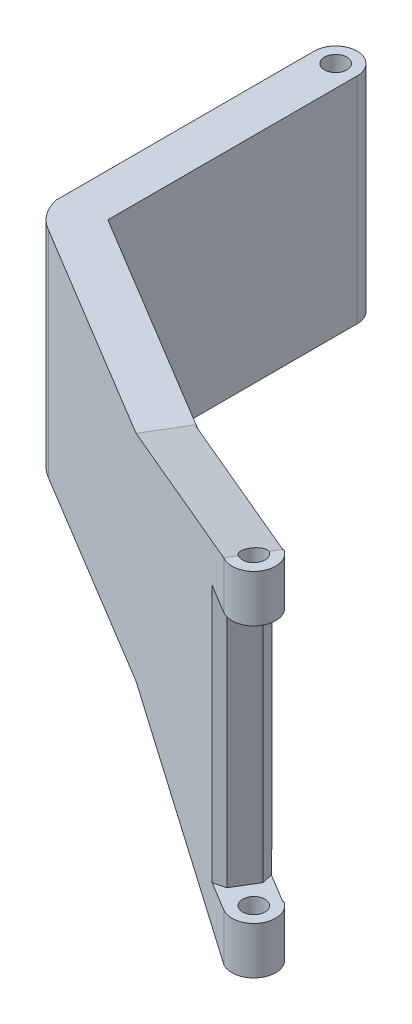
ISO-10303-21;
HEADER;
FILE_DESCRIPTION(('STEP AP214'),'2;1');
FILE_NAME('part.step','',(''),(''),'','','');
FILE_SCHEMA(('AUTOMOTIVE_DESIGN { 1 0 10303 214 1 1 1 1 }'));
ENDSEC;
DATA;
#1=APPLICATION_CONTEXT('core data for automotive mechanical design processes');
#2=APPLICATION_PROTOCOL_DEFINITION('international standard','automotive_design',2000,#1);
#3=PRODUCT_CONTEXT('',#1,'mechanical');
#4=PRODUCT('Part','Part','',(#3));
#5=PRODUCT_RELATED_PRODUCT_CATEGORY('part','',(#4));
#6=PRODUCT_DEFINITION_FORMATION('','',#4);
#7=PRODUCT_DEFINITION_CONTEXT('part definition',#1,'design');
#8=PRODUCT_DEFINITION('design','',#6,#7);
#9=PRODUCT_DEFINITION_SHAPE('','',#8);
#10=(LENGTH_UNIT() NAMED_UNIT(*) SI_UNIT(.MILLI.,.METRE.));
#11=(NAMED_UNIT(*) PLANE_ANGLE_UNIT() SI_UNIT($,.RADIAN.));
#12=(NAMED_UNIT(*) SI_UNIT($,.STERADIAN.) SOLID_ANGLE_UNIT());
#13=UNCERTAINTY_MEASURE_WITH_UNIT(LENGTH_MEASURE(1.E-05),#10,'distance_accuracy_value','');
#14=(GEOMETRIC_REPRESENTATION_CONTEXT(3) GLOBAL_UNCERTAINTY_ASSIGNED_CONTEXT((#13)) GLOBAL_UNIT_ASSIGNED_CONTEXT((#10,
#11,#12)) REPRESENTATION_CONTEXT('',''));
#15=CARTESIAN_POINT('',(0.,0.,0.));
#16=DIRECTION('',(0.,0.,1.));
#17=DIRECTION('',(1.,0.,0.));
#18=AXIS2_PLACEMENT_3D('',#15,#16,#17);
#19=CARTESIAN_POINT('',(0.,0.,0.));
#20=DIRECTION('',(0.,1.,0.));
#21=DIRECTION('',(0.,0.,1.));
#22=AXIS2_PLACEMENT_3D('',#19,#20,#21);
#23=PLANE('',#22);
#24=CARTESIAN_POINT('',(0.,0.,0.));
#25=DIRECTION('',(0.,1.,0.));
#26=DIRECTION('',(0.,0.,1.));
#27=AXIS2_PLACEMENT_3D('',#24,#25,#26);
#28=CIRCLE('',#27,1.3);
#29=CARTESIAN_POINT('',(0.,0.,1.3));
#30=VERTEX_POINT('',#29);
#31=EDGE_CURVE('E268',#30,#30,#28,.T.);
#32=ORIENTED_EDGE('',*,*,#31,.T.);
#33=EDGE_LOOP('',(#32));
#34=FACE_BOUND('',#33,.T.);
#35=DIRECTION('',(0.856776949100166,0.,0.515687172121443));
#36=VECTOR('',#35,1.);
#37=CARTESIAN_POINT('',(-12.1595688964329,0.,20.2022445092072));
#38=LINE('',#37,#36);
#39=CARTESIAN_POINT('',(2.5,0.,29.0257214207424));
#40=VERTEX_POINT('',#39);
#41=CARTESIAN_POINT('',(50.5344164306656,0.,57.9372513115143));
#42=VERTEX_POINT('',#41);
#43=EDGE_CURVE('E249',#40,#42,#38,.T.);
#44=ORIENTED_EDGE('',*,*,#43,.T.);
#45=DIRECTION('',(0.241186894295069,0.,0.970478687051034));
#46=VECTOR('',#45,1.);
#47=CARTESIAN_POINT('',(50.8755062076444,0.,59.3097154327359));
#48=LINE('',#47,#46);
#49=CARTESIAN_POINT('',(50.5657693252667,0.,58.0634079008954));
#50=VERTEX_POINT('',#49);
#51=EDGE_CURVE('E64',#42,#50,#48,.T.);
#52=ORIENTED_EDGE('',*,*,#51,.T.);
#53=DIRECTION('',(0.856776949100167,0.,0.515687172121443));
#54=VECTOR('',#53,1.);
#55=CARTESIAN_POINT('',(28.2462791201418,0.,44.629485805814));
#56=LINE('',#55,#54);
#57=CARTESIAN_POINT('',(28.2462791201418,0.,44.629485805814));
#58=VERTEX_POINT('',#57);
#59=EDGE_CURVE('E362',#58,#50,#56,.T.);
#60=ORIENTED_EDGE('',*,*,#59,.F.);
#61=DIRECTION('',(-0.515687172121443,0.,0.856776949100166));
#62=VECTOR('',#61,1.);
#63=CARTESIAN_POINT('',(28.2462791201418,0.,44.629485805814));
#64=LINE('',#63,#62);
#65=CARTESIAN_POINT('',(25.6678432595346,0.,48.9133705513149));
#66=VERTEX_POINT('',#65);
#67=EDGE_CURVE('E369',#58,#66,#64,.T.);
#68=ORIENTED_EDGE('',*,*,#67,.T.);
#69=DIRECTION('',(-0.856776949100167,0.,-0.515687172121443));
#70=VECTOR('',#69,1.);
#71=CARTESIAN_POINT('',(-14.7854066044301,0.,24.5648839966991));
#72=LINE('',#71,#70);
#73=CARTESIAN_POINT('',(0.,0.,33.4641016151378));
#74=VERTEX_POINT('',#73);
#75=EDGE_CURVE('E247',#66,#74,#72,.T.);
#76=ORIENTED_EDGE('',*,*,#75,.T.);
#77=CARTESIAN_POINT('',(2.5,0.,29.0257214207424));
#78=DIRECTION('',(0.,1.,0.));
#79=DIRECTION('',(0.,0.,1.));
#80=AXIS2_PLACEMENT_3D('',#77,#78,#79);
#81=CIRCLE('',#80,5.09403756856976);
#82=CARTESIAN_POINT('',(-2.5,0.,30.));
#83=VERTEX_POINT('',#82);
#84=EDGE_CURVE('E243',#83,#74,#81,.T.);
#85=ORIENTED_EDGE('',*,*,#84,.F.);
#86=DIRECTION('',(0.,0.,1.));
#87=VECTOR('',#86,1.);
#88=CARTESIAN_POINT('',(-2.5,0.,0.));
#89=LINE('',#88,#87);
#90=CARTESIAN_POINT('',(-2.5,0.,0.));
#91=VERTEX_POINT('',#90);
#92=EDGE_CURVE('E240',#91,#83,#89,.T.);
#93=ORIENTED_EDGE('',*,*,#92,.F.);
#94=CARTESIAN_POINT('',(0.,0.,0.));
#95=DIRECTION('',(0.,1.,0.));
#96=DIRECTION('',(0.,0.,1.));
#97=AXIS2_PLACEMENT_3D('',#94,#95,#96);
#98=CIRCLE('',#97,2.5);
#99=CARTESIAN_POINT('',(2.5,0.,0.));
#100=VERTEX_POINT('',#99);
#101=EDGE_CURVE('E286',#100,#91,#98,.T.);
#102=ORIENTED_EDGE('',*,*,#101,.F.);
#103=DIRECTION('',(0.,0.,1.));
#104=VECTOR('',#103,1.);
#105=CARTESIAN_POINT('',(2.5,0.,0.));
#106=LINE('',#105,#104);
#107=EDGE_CURVE('E251',#100,#40,#106,.T.);
#108=ORIENTED_EDGE('',*,*,#107,.T.);
#109=EDGE_LOOP('',(#44,#52,#60,#68,#76,#85,#93,#102,#108));
#110=FACE_BOUND('',#109,.T.);
#111=ADVANCED_FACE('F41',(#34,#110),#23,.F.);
#112=CARTESIAN_POINT('',(53.9615242270663,33.,60.0000000000001));
#113=DIRECTION('',(0.856776949100163,0.,0.515687172121449));
#114=DIRECTION('',(0.515687172121449,0.,-0.856776949100163));
#115=AXIS2_PLACEMENT_3D('',#112,#113,#114);
#116=PLANE('',#115);
#117=DIRECTION('',(-0.515687172121449,0.,0.856776949100163));
#118=VECTOR('',#117,1.);
#119=CARTESIAN_POINT('',(53.9615242270663,-2.5,60.0000000000001));
#120=LINE('',#119,#118);
#121=CARTESIAN_POINT('',(53.9615242270663,-2.5,60.0000000000001));
#122=VERTEX_POINT('',#121);
#123=CARTESIAN_POINT('',(53.9141223796763,-2.5,60.0787547419911));
#124=VERTEX_POINT('',#123);
#125=EDGE_CURVE('E349',#122,#124,#120,.T.);
#126=ORIENTED_EDGE('',*,*,#125,.F.);
#127=DIRECTION('',(0.,-1.,0.));
#128=VECTOR('',#127,1.);
#129=CARTESIAN_POINT('',(53.9615242270663,33.,60.0000000000001));
#130=LINE('',#129,#128);
#131=CARTESIAN_POINT('',(53.9615242270663,-8.,60.0000000000001));
#132=VERTEX_POINT('',#131);
#133=EDGE_CURVE('E237',#122,#132,#130,.T.);
#134=ORIENTED_EDGE('',*,*,#133,.T.);
#135=DIRECTION('',(-0.515687172121449,0.,0.856776949100163));
#136=VECTOR('',#135,1.);
#137=CARTESIAN_POINT('',(53.9615242270663,-8.,60.0000000000001));
#138=LINE('',#137,#136);
#139=CARTESIAN_POINT('',(53.9141223796763,-8.,60.0787547419911));
#140=VERTEX_POINT('',#139);
#141=EDGE_CURVE('E229',#132,#140,#138,.T.);
#142=ORIENTED_EDGE('',*,*,#141,.T.);
#143=DIRECTION('',(0.,-1.,0.));
#144=VECTOR('',#143,1.);
#145=CARTESIAN_POINT('',(53.9141223796763,0.,60.0787547419911));
#146=LINE('',#145,#144);
#147=EDGE_CURVE('E367',#124,#140,#146,.T.);
#148=ORIENTED_EDGE('',*,*,#147,.F.);
#149=EDGE_LOOP('',(#126,#134,#142,#148));
#150=FACE_BOUND('',#149,.T.);
#151=ADVANCED_FACE('F422',(#150),#116,.F.);
#152=DIRECTION('',(0.515687172121449,0.,-0.856776949100163));
#153=VECTOR('',#152,1.);
#154=CARTESIAN_POINT('',(53.9615242270663,27.5,60.0000000000001));
#155=LINE('',#154,#153);
#156=CARTESIAN_POINT('',(53.9141223796763,27.5,60.0787547419911));
#157=VERTEX_POINT('',#156);
#158=CARTESIAN_POINT('',(53.9615242270663,27.5,60.0000000000001));
#159=VERTEX_POINT('',#158);
#160=EDGE_CURVE('E188',#157,#159,#155,.T.);
#161=ORIENTED_EDGE('',*,*,#160,.F.);
#162=DIRECTION('',(0.,1.,0.));
#163=VECTOR('',#162,1.);
#164=CARTESIAN_POINT('',(53.9141223796763,25.,60.0787547419911));
#165=LINE('',#164,#163);
#166=CARTESIAN_POINT('',(53.9141223796763,33.,60.0787547419911));
#167=VERTEX_POINT('',#166);
#168=EDGE_CURVE('E199',#157,#167,#165,.T.);
#169=ORIENTED_EDGE('',*,*,#168,.T.);
#170=DIRECTION('',(-0.515687172121449,0.,0.856776949100163));
#171=VECTOR('',#170,1.);
#172=CARTESIAN_POINT('',(53.9615242270663,33.,60.0000000000001));
#173=LINE('',#172,#171);
#174=CARTESIAN_POINT('',(53.9615242270663,33.,60.0000000000001));
#175=VERTEX_POINT('',#174);
#176=EDGE_CURVE('E235',#175,#167,#173,.T.);
#177=ORIENTED_EDGE('',*,*,#176,.F.);
#178=EDGE_CURVE('E201',#175,#159,#130,.T.);
#179=ORIENTED_EDGE('',*,*,#178,.T.);
#180=EDGE_LOOP('',(#161,#169,#177,#179));
#181=FACE_BOUND('',#180,.T.);
#182=ADVANCED_FACE('F197',(#181),#116,.F.);
#183=CARTESIAN_POINT('',(0.,25.,0.));
#184=DIRECTION('',(0.,1.,0.));
#185=DIRECTION('',(0.,0.,1.));
#186=AXIS2_PLACEMENT_3D('',#183,#184,#185);
#187=PLANE('',#186);
#188=CARTESIAN_POINT('',(0.,25.,0.));
#189=DIRECTION('',(0.,1.,0.));
#190=DIRECTION('',(0.,0.,1.));
#191=AXIS2_PLACEMENT_3D('',#188,#189,#190);
#192=CIRCLE('',#191,1.3);
#193=CARTESIAN_POINT('',(0.,25.,1.3));
#194=VERTEX_POINT('',#193);
#195=EDGE_CURVE('E283',#194,#194,#192,.T.);
#196=ORIENTED_EDGE('',*,*,#195,.F.);
#197=EDGE_LOOP('',(#196));
#198=FACE_BOUND('',#197,.T.);
#199=DIRECTION('',(0.856776949100167,0.,0.515687172121443));
#200=VECTOR('',#199,1.);
#201=CARTESIAN_POINT('',(28.2462791201418,25.,44.629485805814));
#202=LINE('',#201,#200);
#203=CARTESIAN_POINT('',(28.2462791201418,25.,44.629485805814));
#204=VERTEX_POINT('',#203);
#205=CARTESIAN_POINT('',(50.5657693252667,25.,58.0634079008954));
#206=VERTEX_POINT('',#205);
#207=EDGE_CURVE('E209',#204,#206,#202,.T.);
#208=ORIENTED_EDGE('',*,*,#207,.T.);
#209=DIRECTION('',(-0.241186894295069,0.,-0.970478687051034));
#210=VECTOR('',#209,1.);
#211=CARTESIAN_POINT('',(34.0335893618822,25.,-8.45815145600866));
#212=LINE('',#211,#210);
#213=CARTESIAN_POINT('',(50.5344164306656,25.,57.9372513115143));
#214=VERTEX_POINT('',#213);
#215=EDGE_CURVE('E315',#206,#214,#212,.T.);
#216=ORIENTED_EDGE('',*,*,#215,.T.);
#217=DIRECTION('',(0.856776949100166,0.,0.515687172121443));
#218=VECTOR('',#217,1.);
#219=CARTESIAN_POINT('',(-12.1595688964329,25.,20.2022445092072));
#220=LINE('',#219,#218);
#221=CARTESIAN_POINT('',(2.5,25.,29.0257214207424));
#222=VERTEX_POINT('',#221);
#223=EDGE_CURVE('E261',#222,#214,#220,.T.);
#224=ORIENTED_EDGE('',*,*,#223,.F.);
#225=DIRECTION('',(0.,0.,1.));
#226=VECTOR('',#225,1.);
#227=CARTESIAN_POINT('',(2.5,25.,0.));
#228=LINE('',#227,#226);
#229=CARTESIAN_POINT('',(2.5,25.,0.));
#230=VERTEX_POINT('',#229);
#231=EDGE_CURVE('E244',#230,#222,#228,.T.);
#232=ORIENTED_EDGE('',*,*,#231,.F.);
#233=CARTESIAN_POINT('',(0.,25.,0.));
#234=DIRECTION('',(0.,1.,0.));
#235=DIRECTION('',(0.,0.,1.));
#236=AXIS2_PLACEMENT_3D('',#233,#234,#235);
#237=CIRCLE('',#236,2.5);
#238=CARTESIAN_POINT('',(-2.5,25.,0.));
#239=VERTEX_POINT('',#238);
#240=EDGE_CURVE('E289',#230,#239,#237,.T.);
#241=ORIENTED_EDGE('',*,*,#240,.T.);
#242=DIRECTION('',(0.,0.,1.));
#243=VECTOR('',#242,1.);
#244=CARTESIAN_POINT('',(-2.5,25.,0.));
#245=LINE('',#244,#243);
#246=CARTESIAN_POINT('',(-2.5,25.,30.));
#247=VERTEX_POINT('',#246);
#248=EDGE_CURVE('E239',#239,#247,#245,.T.);
#249=ORIENTED_EDGE('',*,*,#248,.T.);
#250=CARTESIAN_POINT('',(2.5,25.,29.0257214207424));
#251=DIRECTION('',(0.,1.,0.));
#252=DIRECTION('',(0.,0.,1.));
#253=AXIS2_PLACEMENT_3D('',#250,#251,#252);
#254=CIRCLE('',#253,5.09403756856976);
#255=CARTESIAN_POINT('',(0.,25.,33.4641016151378));
#256=VERTEX_POINT('',#255);
#257=EDGE_CURVE('E256',#247,#256,#254,.T.);
#258=ORIENTED_EDGE('',*,*,#257,.T.);
#259=DIRECTION('',(-0.856776949100167,0.,-0.515687172121443));
#260=VECTOR('',#259,1.);
#261=CARTESIAN_POINT('',(-14.7854066044301,25.,24.5648839966991));
#262=LINE('',#261,#260);
#263=CARTESIAN_POINT('',(25.6678432595346,25.,48.9133705513149));
#264=VERTEX_POINT('',#263);
#265=EDGE_CURVE('E259',#264,#256,#262,.T.);
#266=ORIENTED_EDGE('',*,*,#265,.F.);
#267=DIRECTION('',(-0.515687172121443,0.,0.856776949100166));
#268=VECTOR('',#267,1.);
#269=CARTESIAN_POINT('',(28.2462791201418,25.,44.629485805814));
#270=LINE('',#269,#268);
#271=EDGE_CURVE('E221',#204,#264,#270,.T.);
#272=ORIENTED_EDGE('',*,*,#271,.F.);
#273=EDGE_LOOP('',(#208,#216,#224,#232,#241,#249,#258,#266,#272));
#274=FACE_BOUND('',#273,.T.);
#275=ADVANCED_FACE('F404',(#198,#274),#187,.T.);
#276=CARTESIAN_POINT('',(-12.1595688964329,0.,20.2022445092072));
#277=DIRECTION('',(-0.515687172121443,0.,0.856776949100166));
#278=DIRECTION('',(0.856776949100166,0.,0.515687172121443));
#279=AXIS2_PLACEMENT_3D('',#276,#277,#278);
#280=PLANE('',#279);
#281=ORIENTED_EDGE('',*,*,#223,.T.);
#282=DIRECTION('',(0.,-1.,0.));
#283=VECTOR('',#282,1.);
#284=CARTESIAN_POINT('',(50.5344164306656,0.,57.9372513115143));
#285=LINE('',#284,#283);
#286=EDGE_CURVE('E317',#214,#42,#285,.T.);
#287=ORIENTED_EDGE('',*,*,#286,.T.);
#288=ORIENTED_EDGE('',*,*,#43,.F.);
#289=DIRECTION('',(0.,1.,0.));
#290=VECTOR('',#289,1.);
#291=CARTESIAN_POINT('',(2.5,0.,29.0257214207424));
#292=LINE('',#291,#290);
#293=EDGE_CURVE('E272',#40,#222,#292,.T.);
#294=ORIENTED_EDGE('',*,*,#293,.T.);
#295=EDGE_LOOP('',(#281,#287,#288,#294));
#296=FACE_BOUND('',#295,.T.);
#297=ADVANCED_FACE('F411',(#296),#280,.F.);
#298=CARTESIAN_POINT('',(-14.7854066044301,0.,24.5648839966991));
#299=DIRECTION('',(0.515687172121443,0.,-0.856776949100166));
#300=DIRECTION('',(-0.856776949100167,0.,-0.515687172121443));
#301=AXIS2_PLACEMENT_3D('',#298,#299,#300);
#302=PLANE('',#301);
#303=DIRECTION('',(0.856776949100167,0.,0.515687172121443));
#304=VECTOR('',#303,1.);
#305=CARTESIAN_POINT('',(-14.7854066044301,-2.5,24.5648839966991));
#306=LINE('',#305,#304);
#307=CARTESIAN_POINT('',(47.9085787226684,-2.5,62.2998907990061));
#308=VERTEX_POINT('',#307);
#309=CARTESIAN_POINT('',(51.3356865190691,-2.5,64.3626394874919));
#310=VERTEX_POINT('',#309);
#311=EDGE_CURVE('E342',#308,#310,#306,.T.);
#312=ORIENTED_EDGE('',*,*,#311,.F.);
#313=DIRECTION('',(0.,1.,0.));
#314=VECTOR('',#313,1.);
#315=CARTESIAN_POINT('',(47.9085787226684,27.5,62.2998907990061));
#316=LINE('',#315,#314);
#317=CARTESIAN_POINT('',(47.9085787226684,27.5,62.2998907990061));
#318=VERTEX_POINT('',#317);
#319=EDGE_CURVE('E310',#308,#318,#316,.T.);
#320=ORIENTED_EDGE('',*,*,#319,.T.);
#321=DIRECTION('',(-0.856776949100167,0.,-0.515687172121443));
#322=VECTOR('',#321,1.);
#323=CARTESIAN_POINT('',(-14.7854066044301,27.5,24.5648839966991));
#324=LINE('',#323,#322);
#325=CARTESIAN_POINT('',(51.3356865190691,27.5,64.3626394874919));
#326=VERTEX_POINT('',#325);
#327=EDGE_CURVE('E304',#326,#318,#324,.T.);
#328=ORIENTED_EDGE('',*,*,#327,.F.);
#329=DIRECTION('',(0.,1.,0.));
#330=VECTOR('',#329,1.);
#331=CARTESIAN_POINT('',(51.3356865190691,0.,64.3626394874919));
#332=LINE('',#331,#330);
#333=CARTESIAN_POINT('',(51.335686519069,33.,64.3626394874919));
#334=VERTEX_POINT('',#333);
#335=EDGE_CURVE('E278',#326,#334,#332,.T.);
#336=ORIENTED_EDGE('',*,*,#335,.T.);
#337=DIRECTION('',(-0.827771842353987,-0.257994981186121,-0.498229231066041));
#338=VECTOR('',#337,1.);
#339=CARTESIAN_POINT('',(51.3356865190691,33.,64.3626394874919));
#340=LINE('',#339,#338);
#341=EDGE_CURVE('E214',#334,#264,#340,.T.);
#342=ORIENTED_EDGE('',*,*,#341,.T.);
#343=ORIENTED_EDGE('',*,*,#265,.T.);
#344=DIRECTION('',(0.,1.,0.));
#345=VECTOR('',#344,1.);
#346=CARTESIAN_POINT('',(0.,0.,33.4641016151378));
#347=LINE('',#346,#345);
#348=EDGE_CURVE('E279',#74,#256,#347,.T.);
#349=ORIENTED_EDGE('',*,*,#348,.F.);
#350=ORIENTED_EDGE('',*,*,#75,.F.);
#351=DIRECTION('',(-0.827771842353987,0.257994981186121,-0.498229231066041));
#352=VECTOR('',#351,1.);
#353=CARTESIAN_POINT('',(51.3356865190691,-8.,64.3626394874919));
#354=LINE('',#353,#352);
#355=CARTESIAN_POINT('',(51.3356865190691,-8.,64.3626394874919));
#356=VERTEX_POINT('',#355);
#357=EDGE_CURVE('E361',#356,#66,#354,.T.);
#358=ORIENTED_EDGE('',*,*,#357,.F.);
#359=EDGE_CURVE('E275',#356,#310,#332,.T.);
#360=ORIENTED_EDGE('',*,*,#359,.T.);
#361=EDGE_LOOP('',(#312,#320,#328,#336,#342,#343,#349,#350,#358,#360));
#362=FACE_BOUND('',#361,.T.);
#363=ADVANCED_FACE('F390',(#362),#302,.F.);
#364=CARTESIAN_POINT('',(52.6486053730677,33.,62.181319743746));
#365=DIRECTION('',(0.,-1.,0.));
#366=DIRECTION('',(0.,0.,-1.));
#367=AXIS2_PLACEMENT_3D('',#364,#365,#366);
#368=CYLINDRICAL_SURFACE('',#367,2.54595988610208);
#369=CARTESIAN_POINT('',(52.6486053730677,-2.5,62.181319743746));
#370=DIRECTION('',(0.,1.,0.));
#371=DIRECTION('',(0.,0.,1.));
#372=AXIS2_PLACEMENT_3D('',#369,#370,#371);
#373=CIRCLE('',#372,2.54595988610208);
#374=EDGE_CURVE('E351',#122,#310,#373,.F.);
#375=ORIENTED_EDGE('',*,*,#374,.T.);
#376=ORIENTED_EDGE('',*,*,#359,.F.);
#377=CARTESIAN_POINT('',(52.6486053730677,-8.,62.181319743746));
#378=DIRECTION('',(0.,-1.,0.));
#379=DIRECTION('',(0.,0.,-1.));
#380=AXIS2_PLACEMENT_3D('',#377,#378,#379);
#381=CIRCLE('',#380,2.54595988610208);
#382=EDGE_CURVE('E223',#132,#356,#381,.T.);
#383=ORIENTED_EDGE('',*,*,#382,.F.);
#384=ORIENTED_EDGE('',*,*,#133,.F.);
#385=EDGE_LOOP('',(#375,#376,#383,#384));
#386=FACE_BOUND('',#385,.T.);
#387=ADVANCED_FACE('F384',(#386),#368,.T.);
#388=CARTESIAN_POINT('',(52.6486053730677,27.5,62.181319743746));
#389=DIRECTION('',(0.,-1.,0.));
#390=DIRECTION('',(0.,0.,-1.));
#391=AXIS2_PLACEMENT_3D('',#388,#389,#390);
#392=CIRCLE('',#391,2.54595988610208);
#393=EDGE_CURVE('E202',#326,#159,#392,.F.);
#394=ORIENTED_EDGE('',*,*,#393,.T.);
#395=ORIENTED_EDGE('',*,*,#178,.F.);
#396=CARTESIAN_POINT('',(52.6486053730677,33.,62.181319743746));
#397=DIRECTION('',(0.,-1.,0.));
#398=DIRECTION('',(0.,0.,-1.));
#399=AXIS2_PLACEMENT_3D('',#396,#397,#398);
#400=CIRCLE('',#399,2.54595988610208);
#401=EDGE_CURVE('E232',#175,#334,#400,.T.);
#402=ORIENTED_EDGE('',*,*,#401,.T.);
#403=ORIENTED_EDGE('',*,*,#335,.F.);
#404=EDGE_LOOP('',(#394,#395,#402,#403));
#405=FACE_BOUND('',#404,.T.);
#406=ADVANCED_FACE('F437',(#405),#368,.T.);
#407=CARTESIAN_POINT('',(-12.2069707438229,0.,20.2809992511983));
#408=DIRECTION('',(-0.515687172121443,0.,0.856776949100167));
#409=DIRECTION('',(0.856776949100167,0.,0.515687172121443));
#410=AXIS2_PLACEMENT_3D('',#407,#408,#409);
#411=PLANE('',#410);
#412=DIRECTION('',(0.856776949100167,0.,0.515687172121443));
#413=VECTOR('',#412,1.);
#414=CARTESIAN_POINT('',(-12.2069707438229,27.5,20.2809992511983));
#415=LINE('',#414,#413);
#416=CARTESIAN_POINT('',(50.5657693252667,27.5,58.0634079008954));
#417=VERTEX_POINT('',#416);
#418=EDGE_CURVE('E185',#417,#157,#415,.T.);
#419=ORIENTED_EDGE('',*,*,#418,.F.);
#420=DIRECTION('',(0.,-1.,0.));
#421=VECTOR('',#420,1.);
#422=CARTESIAN_POINT('',(50.5657693252667,0.,58.0634079008954));
#423=LINE('',#422,#421);
#424=EDGE_CURVE('E313',#417,#206,#423,.T.);
#425=ORIENTED_EDGE('',*,*,#424,.T.);
#426=ORIENTED_EDGE('',*,*,#207,.F.);
#427=DIRECTION('',(-0.827771842353987,-0.257994981186121,-0.498229231066041));
#428=VECTOR('',#427,1.);
#429=CARTESIAN_POINT('',(53.9141223796763,33.,60.0787547419911));
#430=LINE('',#429,#428);
#431=EDGE_CURVE('E207',#167,#204,#430,.T.);
#432=ORIENTED_EDGE('',*,*,#431,.F.);
#433=ORIENTED_EDGE('',*,*,#168,.F.);
#434=EDGE_LOOP('',(#419,#425,#426,#432,#433));
#435=FACE_BOUND('',#434,.T.);
#436=ADVANCED_FACE('F205',(#435),#411,.F.);
#437=CARTESIAN_POINT('',(-12.2069707438229,25.,20.2809992511983));
#438=DIRECTION('',(-0.515687172121443,0.,0.856776949100167));
#439=DIRECTION('',(0.856776949100167,0.,0.515687172121443));
#440=AXIS2_PLACEMENT_3D('',#437,#438,#439);
#441=PLANE('',#440);
#442=DIRECTION('',(0.,-1.,0.));
#443=VECTOR('',#442,1.);
#444=CARTESIAN_POINT('',(50.5657693252667,0.,58.0634079008954));
#445=LINE('',#444,#443);
#446=CARTESIAN_POINT('',(50.5657693252667,-2.5,58.0634079008954));
#447=VERTEX_POINT('',#446);
#448=EDGE_CURVE('E319',#50,#447,#445,.T.);
#449=ORIENTED_EDGE('',*,*,#448,.T.);
#450=DIRECTION('',(-0.856776949100167,0.,-0.515687172121443));
#451=VECTOR('',#450,1.);
#452=CARTESIAN_POINT('',(-12.2069707438229,-2.5,20.2809992511983));
#453=LINE('',#452,#451);
#454=EDGE_CURVE('E56',#124,#447,#453,.T.);
#455=ORIENTED_EDGE('',*,*,#454,.F.);
#456=ORIENTED_EDGE('',*,*,#147,.T.);
#457=DIRECTION('',(-0.827771842353987,0.257994981186121,-0.498229231066041));
#458=VECTOR('',#457,1.);
#459=CARTESIAN_POINT('',(53.9141223796763,-8.,60.0787547419911));
#460=LINE('',#459,#458);
#461=EDGE_CURVE('E364',#140,#58,#460,.T.);
#462=ORIENTED_EDGE('',*,*,#461,.T.);
#463=ORIENTED_EDGE('',*,*,#59,.T.);
#464=EDGE_LOOP('',(#449,#455,#456,#462,#463));
#465=FACE_BOUND('',#464,.T.);
#466=ADVANCED_FACE('F417',(#465),#441,.F.);
#467=CARTESIAN_POINT('',(52.6486053730677,-8.,62.181319743746));
#468=DIRECTION('',(0.,1.,0.));
#469=DIRECTION('',(0.,0.,1.));
#470=AXIS2_PLACEMENT_3D('',#467,#468,#469);
#471=CYLINDRICAL_SURFACE('',#470,1.3);
#472=CARTESIAN_POINT('',(52.6486053730677,-8.,62.181319743746));
#473=DIRECTION('',(0.,1.,0.));
#474=DIRECTION('',(0.,0.,1.));
#475=AXIS2_PLACEMENT_3D('',#472,#473,#474);
#476=CIRCLE('',#475,1.3);
#477=CARTESIAN_POINT('',(51.9782120493098,-8.,63.2951297775762));
#478=VERTEX_POINT('',#477);
#479=CARTESIAN_POINT('',(53.3189986968256,-8.,61.0675097099158));
#480=VERTEX_POINT('',#479);
#481=EDGE_CURVE('E356',#478,#480,#476,.T.);
#482=ORIENTED_EDGE('',*,*,#481,.F.);
#483=CARTESIAN_POINT('',(52.6486053730677,-8.,62.181319743746));
#484=DIRECTION('',(0.2210441528638,0.966146256879761,0.133044702269396));
#485=DIRECTION('',(-0.827771842353987,0.257994981186121,-0.498229231066041));
#486=AXIS2_PLACEMENT_3D('',#483,#484,#485);
#487=ELLIPSE('',#486,1.3455519707735,1.3);
#488=EDGE_CURVE('E292',#480,#478,#487,.T.);
#489=ORIENTED_EDGE('',*,*,#488,.F.);
#490=EDGE_LOOP('',(#482,#489));
#491=FACE_BOUND('',#490,.T.);
#492=CARTESIAN_POINT('',(52.6486053730677,-2.5,62.181319743746));
#493=DIRECTION('',(0.,1.,0.));
#494=DIRECTION('',(0.,0.,1.));
#495=AXIS2_PLACEMENT_3D('',#492,#493,#494);
#496=CIRCLE('',#495,1.3);
#497=CARTESIAN_POINT('',(52.6486053730677,-2.5,63.481319743746));
#498=VERTEX_POINT('',#497);
#499=EDGE_CURVE('E301',#498,#498,#496,.F.);
#500=ORIENTED_EDGE('',*,*,#499,.F.);
#501=EDGE_LOOP('',(#500));
#502=FACE_BOUND('',#501,.T.);
#503=ADVANCED_FACE('F476',(#491,#502),#471,.F.);
#504=CARTESIAN_POINT('',(52.6486053730677,33.,62.181319743746));
#505=DIRECTION('',(-0.2210441528638,0.966146256879761,-0.133044702269396));
#506=DIRECTION('',(0.827771842353987,0.257994981186121,0.498229231066041));
#507=AXIS2_PLACEMENT_3D('',#504,#505,#506);
#508=ELLIPSE('',#507,1.3455519707735,1.3);
#509=CARTESIAN_POINT('',(53.3189986968256,33.,61.0675097099158));
#510=VERTEX_POINT('',#509);
#511=CARTESIAN_POINT('',(51.9782120493098,33.,63.2951297775762));
#512=VERTEX_POINT('',#511);
#513=EDGE_CURVE('E359',#510,#512,#508,.T.);
#514=ORIENTED_EDGE('',*,*,#513,.T.);
#515=CARTESIAN_POINT('',(52.6486053730677,33.,62.181319743746));
#516=DIRECTION('',(0.,1.,0.));
#517=DIRECTION('',(0.,0.,1.));
#518=AXIS2_PLACEMENT_3D('',#515,#516,#517);
#519=CIRCLE('',#518,1.3);
#520=EDGE_CURVE('E354',#512,#510,#519,.T.);
#521=ORIENTED_EDGE('',*,*,#520,.T.);
#522=EDGE_LOOP('',(#514,#521));
#523=FACE_BOUND('',#522,.T.);
#524=CARTESIAN_POINT('',(52.6486053730677,27.5,62.181319743746));
#525=DIRECTION('',(0.,-1.,0.));
#526=DIRECTION('',(0.,0.,-1.));
#527=AXIS2_PLACEMENT_3D('',#524,#525,#526);
#528=CIRCLE('',#527,1.3);
#529=CARTESIAN_POINT('',(52.6486053730677,27.5,60.881319743746));
#530=VERTEX_POINT('',#529);
#531=EDGE_CURVE('E194',#530,#530,#528,.F.);
#532=ORIENTED_EDGE('',*,*,#531,.F.);
#533=EDGE_LOOP('',(#532));
#534=FACE_BOUND('',#533,.T.);
#535=ADVANCED_FACE('F457',(#523,#534),#471,.F.);
#536=CARTESIAN_POINT('',(0.,25.,0.));
#537=DIRECTION('',(0.,-1.,0.));
#538=DIRECTION('',(0.,0.,-1.));
#539=AXIS2_PLACEMENT_3D('',#536,#537,#538);
#540=CYLINDRICAL_SURFACE('',#539,2.5);
#541=DIRECTION('',(0.,1.,0.));
#542=VECTOR('',#541,1.);
#543=CARTESIAN_POINT('',(-2.5,0.,0.));
#544=LINE('',#543,#542);
#545=EDGE_CURVE('E265',#91,#239,#544,.T.);
#546=ORIENTED_EDGE('',*,*,#545,.T.);
#547=ORIENTED_EDGE('',*,*,#240,.F.);
#548=DIRECTION('',(0.,1.,0.));
#549=VECTOR('',#548,1.);
#550=CARTESIAN_POINT('',(2.5,0.,0.));
#551=LINE('',#550,#549);
#552=EDGE_CURVE('E269',#100,#230,#551,.T.);
#553=ORIENTED_EDGE('',*,*,#552,.F.);
#554=ORIENTED_EDGE('',*,*,#101,.T.);
#555=EDGE_LOOP('',(#546,#547,#553,#554));
#556=FACE_BOUND('',#555,.T.);
#557=ADVANCED_FACE('F401',(#556),#540,.T.);
#558=CARTESIAN_POINT('',(0.,25.,0.));
#559=DIRECTION('',(0.,-1.,0.));
#560=DIRECTION('',(0.,0.,-1.));
#561=AXIS2_PLACEMENT_3D('',#558,#559,#560);
#562=CYLINDRICAL_SURFACE('',#561,1.3);
#563=ORIENTED_EDGE('',*,*,#195,.T.);
#564=EDGE_LOOP('',(#563));
#565=FACE_BOUND('',#564,.T.);
#566=ORIENTED_EDGE('',*,*,#31,.F.);
#567=EDGE_LOOP('',(#566));
#568=FACE_BOUND('',#567,.T.);
#569=ADVANCED_FACE('F449',(#565,#568),#562,.F.);
#570=CARTESIAN_POINT('',(-2.5,0.,0.));
#571=DIRECTION('',(-1.,0.,0.));
#572=DIRECTION('',(0.,0.,1.));
#573=AXIS2_PLACEMENT_3D('',#570,#571,#572);
#574=PLANE('',#573);
#575=ORIENTED_EDGE('',*,*,#248,.F.);
#576=ORIENTED_EDGE('',*,*,#545,.F.);
#577=ORIENTED_EDGE('',*,*,#92,.T.);
#578=DIRECTION('',(0.,1.,0.));
#579=VECTOR('',#578,1.);
#580=CARTESIAN_POINT('',(-2.5,0.,30.));
#581=LINE('',#580,#579);
#582=EDGE_CURVE('E253',#83,#247,#581,.T.);
#583=ORIENTED_EDGE('',*,*,#582,.T.);
#584=EDGE_LOOP('',(#575,#576,#577,#583));
#585=FACE_BOUND('',#584,.T.);
#586=ADVANCED_FACE('F397',(#585),#574,.T.);
#587=CARTESIAN_POINT('',(2.5,0.,0.));
#588=DIRECTION('',(-1.,0.,0.));
#589=DIRECTION('',(0.,0.,1.));
#590=AXIS2_PLACEMENT_3D('',#587,#588,#589);
#591=PLANE('',#590);
#592=ORIENTED_EDGE('',*,*,#231,.T.);
#593=ORIENTED_EDGE('',*,*,#293,.F.);
#594=ORIENTED_EDGE('',*,*,#107,.F.);
#595=ORIENTED_EDGE('',*,*,#552,.T.);
#596=EDGE_LOOP('',(#592,#593,#594,#595));
#597=FACE_BOUND('',#596,.T.);
#598=ADVANCED_FACE('F408',(#597),#591,.F.);
#599=CARTESIAN_POINT('',(2.5,0.,29.0257214207424));
#600=DIRECTION('',(0.,1.,0.));
#601=DIRECTION('',(0.,0.,1.));
#602=AXIS2_PLACEMENT_3D('',#599,#600,#601);
#603=CYLINDRICAL_SURFACE('',#602,5.09403756856976);
#604=ORIENTED_EDGE('',*,*,#257,.F.);
#605=ORIENTED_EDGE('',*,*,#582,.F.);
#606=ORIENTED_EDGE('',*,*,#84,.T.);
#607=ORIENTED_EDGE('',*,*,#348,.T.);
#608=EDGE_LOOP('',(#604,#605,#606,#607));
#609=FACE_BOUND('',#608,.T.);
#610=ADVANCED_FACE('F440',(#609),#603,.T.);
#611=CARTESIAN_POINT('',(52.6486053730677,33.,62.181319743746));
#612=DIRECTION('',(0.,-1.,0.));
#613=DIRECTION('',(0.,0.,-1.));
#614=AXIS2_PLACEMENT_3D('',#611,#612,#613);
#615=PLANE('',#614);
#616=DIRECTION('',(-0.515687172121443,0.,0.856776949100166));
#617=VECTOR('',#616,1.);
#618=CARTESIAN_POINT('',(53.9141223796763,33.,60.0787547419911));
#619=LINE('',#618,#617);
#620=EDGE_CURVE('E224',#167,#510,#619,.T.);
#621=ORIENTED_EDGE('',*,*,#620,.T.);
#622=ORIENTED_EDGE('',*,*,#520,.F.);
#623=EDGE_CURVE('E211',#512,#334,#619,.T.);
#624=ORIENTED_EDGE('',*,*,#623,.T.);
#625=ORIENTED_EDGE('',*,*,#401,.F.);
#626=ORIENTED_EDGE('',*,*,#176,.T.);
#627=EDGE_LOOP('',(#621,#622,#624,#625,#626));
#628=FACE_BOUND('',#627,.T.);
#629=ADVANCED_FACE('F433',(#628),#615,.F.);
#630=CARTESIAN_POINT('',(52.6486053730677,-8.,62.181319743746));
#631=DIRECTION('',(0.,-1.,0.));
#632=DIRECTION('',(0.,0.,-1.));
#633=AXIS2_PLACEMENT_3D('',#630,#631,#632);
#634=PLANE('',#633);
#635=ORIENTED_EDGE('',*,*,#481,.T.);
#636=DIRECTION('',(-0.515687172121443,0.,0.856776949100166));
#637=VECTOR('',#636,1.);
#638=CARTESIAN_POINT('',(53.9141223796763,-8.,60.0787547419911));
#639=LINE('',#638,#637);
#640=EDGE_CURVE('E220',#140,#480,#639,.T.);
#641=ORIENTED_EDGE('',*,*,#640,.F.);
#642=ORIENTED_EDGE('',*,*,#141,.F.);
#643=ORIENTED_EDGE('',*,*,#382,.T.);
#644=EDGE_CURVE('E373',#478,#356,#639,.T.);
#645=ORIENTED_EDGE('',*,*,#644,.F.);
#646=EDGE_LOOP('',(#635,#641,#642,#643,#645));
#647=FACE_BOUND('',#646,.T.);
#648=ADVANCED_FACE('F388',(#647),#634,.T.);
#649=CARTESIAN_POINT('',(53.9141223796763,33.,60.0787547419911));
#650=DIRECTION('',(-0.2210441528638,0.966146256879761,-0.133044702269396));
#651=DIRECTION('',(-0.974812301306807,-0.223026853138645,0.));
#652=AXIS2_PLACEMENT_3D('',#649,#650,#651);
#653=PLANE('',#652);
#654=ORIENTED_EDGE('',*,*,#513,.F.);
#655=ORIENTED_EDGE('',*,*,#620,.F.);
#656=ORIENTED_EDGE('',*,*,#431,.T.);
#657=ORIENTED_EDGE('',*,*,#271,.T.);
#658=ORIENTED_EDGE('',*,*,#341,.F.);
#659=ORIENTED_EDGE('',*,*,#623,.F.);
#660=EDGE_LOOP('',(#654,#655,#656,#657,#658,#659));
#661=FACE_BOUND('',#660,.T.);
#662=ADVANCED_FACE('F484',(#661),#653,.T.);
#663=CARTESIAN_POINT('',(53.9141223796763,-8.,60.0787547419911));
#664=DIRECTION('',(0.2210441528638,0.966146256879761,0.133044702269396));
#665=DIRECTION('',(-0.974812301306807,0.223026853138645,0.));
#666=AXIS2_PLACEMENT_3D('',#663,#664,#665);
#667=PLANE('',#666);
#668=ORIENTED_EDGE('',*,*,#640,.T.);
#669=ORIENTED_EDGE('',*,*,#488,.T.);
#670=ORIENTED_EDGE('',*,*,#644,.T.);
#671=ORIENTED_EDGE('',*,*,#357,.T.);
#672=ORIENTED_EDGE('',*,*,#67,.F.);
#673=ORIENTED_EDGE('',*,*,#461,.F.);
#674=EDGE_LOOP('',(#668,#669,#670,#671,#672,#673));
#675=FACE_BOUND('',#674,.T.);
#676=ADVANCED_FACE('F379',(#675),#667,.F.);
#677=CARTESIAN_POINT('',(34.2875475324009,0.,86.8694093594016));
#678=DIRECTION('',(0.856776949100166,0.,0.515687172121443));
#679=DIRECTION('',(0.515687172121443,0.,-0.856776949100166));
#680=AXIS2_PLACEMENT_3D('',#677,#678,#679);
#681=PLANE('',#680);
#682=DIRECTION('',(0.515687172121443,0.,-0.856776949100166));
#683=VECTOR('',#682,1.);
#684=CARTESIAN_POINT('',(34.2875475324009,27.5,86.8694093594017));
#685=LINE('',#684,#683);
#686=CARTESIAN_POINT('',(49.2810428438901,27.5,61.9588010220274));
#687=VERTEX_POINT('',#686);
#688=CARTESIAN_POINT('',(50.8755062076444,27.5,59.3097154327359));
#689=VERTEX_POINT('',#688);
#690=EDGE_CURVE('E328',#687,#689,#685,.T.);
#691=ORIENTED_EDGE('',*,*,#690,.F.);
#692=DIRECTION('',(0.,-1.,0.));
#693=VECTOR('',#692,1.);
#694=CARTESIAN_POINT('',(49.28104284389,-2.5,61.9588010220274));
#695=LINE('',#694,#693);
#696=CARTESIAN_POINT('',(49.28104284389,-2.5,61.9588010220274));
#697=VERTEX_POINT('',#696);
#698=EDGE_CURVE('E307',#687,#697,#695,.T.);
#699=ORIENTED_EDGE('',*,*,#698,.T.);
#700=DIRECTION('',(0.515687172121443,0.,-0.856776949100166));
#701=VECTOR('',#700,1.);
#702=CARTESIAN_POINT('',(34.2875475324009,-2.5,86.8694093594016));
#703=LINE('',#702,#701);
#704=CARTESIAN_POINT('',(50.8755062076444,-2.5,59.3097154327359));
#705=VERTEX_POINT('',#704);
#706=EDGE_CURVE('E300',#697,#705,#703,.T.);
#707=ORIENTED_EDGE('',*,*,#706,.T.);
#708=DIRECTION('',(0.,1.,0.));
#709=VECTOR('',#708,1.);
#710=CARTESIAN_POINT('',(50.8755062076444,25.,59.3097154327359));
#711=LINE('',#710,#709);
#712=EDGE_CURVE('E297',#705,#689,#711,.T.);
#713=ORIENTED_EDGE('',*,*,#712,.T.);
#714=EDGE_LOOP('',(#691,#699,#707,#713));
#715=FACE_BOUND('',#714,.T.);
#716=ADVANCED_FACE('F334',(#715),#681,.T.);
#717=CARTESIAN_POINT('',(-29.2632147437978,-2.5,48.6187153849731));
#718=DIRECTION('',(0.,1.,0.));
#719=DIRECTION('',(0.,0.,1.));
#720=AXIS2_PLACEMENT_3D('',#717,#718,#719);
#721=PLANE('',#720);
#722=ORIENTED_EDGE('',*,*,#499,.T.);
#723=EDGE_LOOP('',(#722));
#724=FACE_BOUND('',#723,.T.);
#725=ORIENTED_EDGE('',*,*,#311,.T.);
#726=ORIENTED_EDGE('',*,*,#374,.F.);
#727=ORIENTED_EDGE('',*,*,#125,.T.);
#728=ORIENTED_EDGE('',*,*,#454,.T.);
#729=DIRECTION('',(0.241186894295069,0.,0.970478687051034));
#730=VECTOR('',#729,1.);
#731=CARTESIAN_POINT('',(50.8755062076444,-2.5,59.3097154327359));
#732=LINE('',#731,#730);
#733=EDGE_CURVE('E11',#447,#705,#732,.T.);
#734=ORIENTED_EDGE('',*,*,#733,.T.);
#735=ORIENTED_EDGE('',*,*,#706,.F.);
#736=DIRECTION('',(-0.970478687051039,0.,0.241186894295051));
#737=VECTOR('',#736,1.);
#738=CARTESIAN_POINT('',(49.28104284389,-2.5,61.9588010220274));
#739=LINE('',#738,#737);
#740=EDGE_CURVE('E322',#697,#308,#739,.T.);
#741=ORIENTED_EDGE('',*,*,#740,.T.);
#742=EDGE_LOOP('',(#725,#726,#727,#728,#734,#735,#741));
#743=FACE_BOUND('',#742,.T.);
#744=ADVANCED_FACE('F341',(#724,#743),#721,.T.);
#745=CARTESIAN_POINT('',(-29.2632147437978,27.5,48.6187153849731));
#746=DIRECTION('',(0.,-1.,0.));
#747=DIRECTION('',(0.,0.,-1.));
#748=AXIS2_PLACEMENT_3D('',#745,#746,#747);
#749=PLANE('',#748);
#750=ORIENTED_EDGE('',*,*,#531,.T.);
#751=EDGE_LOOP('',(#750));
#752=FACE_BOUND('',#751,.T.);
#753=ORIENTED_EDGE('',*,*,#327,.T.);
#754=DIRECTION('',(0.970478687051039,0.,-0.241186894295051));
#755=VECTOR('',#754,1.);
#756=CARTESIAN_POINT('',(49.28104284389,27.5,61.9588010220274));
#757=LINE('',#756,#755);
#758=EDGE_CURVE('E325',#318,#687,#757,.T.);
#759=ORIENTED_EDGE('',*,*,#758,.T.);
#760=ORIENTED_EDGE('',*,*,#690,.T.);
#761=DIRECTION('',(-0.241186894295069,0.,-0.970478687051034));
#762=VECTOR('',#761,1.);
#763=CARTESIAN_POINT('',(50.8755062076444,27.5,59.3097154327359));
#764=LINE('',#763,#762);
#765=EDGE_CURVE('E50',#689,#417,#764,.T.);
#766=ORIENTED_EDGE('',*,*,#765,.T.);
#767=ORIENTED_EDGE('',*,*,#418,.T.);
#768=ORIENTED_EDGE('',*,*,#160,.T.);
#769=ORIENTED_EDGE('',*,*,#393,.F.);
#770=EDGE_LOOP('',(#753,#759,#760,#766,#767,#768,#769));
#771=FACE_BOUND('',#770,.T.);
#772=ADVANCED_FACE('F187',(#752,#771),#749,.T.);
#773=CARTESIAN_POINT('',(49.28104284389,0.,61.9588010220274));
#774=DIRECTION('',(0.241186894295051,0.,0.970478687051039));
#775=DIRECTION('',(0.,1.,0.));
#776=AXIS2_PLACEMENT_3D('',#773,#774,#775);
#777=PLANE('',#776);
#778=ORIENTED_EDGE('',*,*,#758,.F.);
#779=ORIENTED_EDGE('',*,*,#319,.F.);
#780=ORIENTED_EDGE('',*,*,#740,.F.);
#781=ORIENTED_EDGE('',*,*,#698,.F.);
#782=EDGE_LOOP('',(#778,#779,#780,#781));
#783=FACE_BOUND('',#782,.T.);
#784=ADVANCED_FACE('F339',(#783),#777,.T.);
#785=CARTESIAN_POINT('',(50.8755062076444,0.,59.3097154327359));
#786=DIRECTION('',(0.970478687051034,0.,-0.241186894295069));
#787=DIRECTION('',(0.,-1.,0.));
#788=AXIS2_PLACEMENT_3D('',#785,#786,#787);
#789=PLANE('',#788);
#790=ORIENTED_EDGE('',*,*,#51,.F.);
#791=ORIENTED_EDGE('',*,*,#286,.F.);
#792=ORIENTED_EDGE('',*,*,#215,.F.);
#793=ORIENTED_EDGE('',*,*,#424,.F.);
#794=ORIENTED_EDGE('',*,*,#765,.F.);
#795=ORIENTED_EDGE('',*,*,#712,.F.);
#796=ORIENTED_EDGE('',*,*,#733,.F.);
#797=ORIENTED_EDGE('',*,*,#448,.F.);
#798=EDGE_LOOP('',(#790,#791,#792,#793,#794,#795,#796,#797));
#799=FACE_BOUND('',#798,.T.);
#800=ADVANCED_FACE('F44',(#799),#789,.T.);
#801=CLOSED_SHELL('',(#111,#151,#182,#275,#297,#363,#387,#406,#436,#466,#503,#535,#557,#569,
#586,#598,#610,#629,#648,#662,#676,#716,#744,#772,#784,#800));
#802=MANIFOLD_SOLID_BREP('B2',#801);
#803=ADVANCED_BREP_SHAPE_REPRESENTATION('',(#18,#802),#14);
#804=SHAPE_DEFINITION_REPRESENTATION(#9,#803);
ENDSEC;
END-ISO-10303-21;
